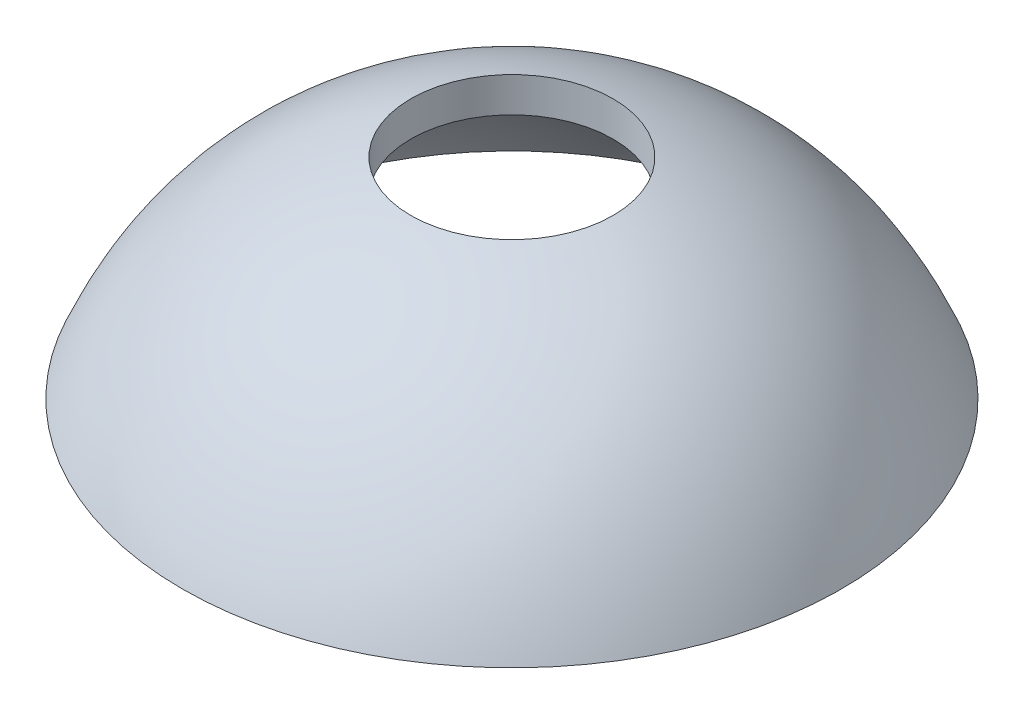
ISO-10303-21;
HEADER;
FILE_DESCRIPTION(('STEP AP214'),'2;1');
FILE_NAME('part.step','',(''),(''),'','','');
FILE_SCHEMA(('AUTOMOTIVE_DESIGN { 1 0 10303 214 1 1 1 1 }'));
ENDSEC;
DATA;
#1=APPLICATION_CONTEXT('core data for automotive mechanical design processes');
#2=APPLICATION_PROTOCOL_DEFINITION('international standard','automotive_design',2000,#1);
#3=PRODUCT_CONTEXT('',#1,'mechanical');
#4=PRODUCT('Part','Part','',(#3));
#5=PRODUCT_RELATED_PRODUCT_CATEGORY('part','',(#4));
#6=PRODUCT_DEFINITION_FORMATION('','',#4);
#7=PRODUCT_DEFINITION_CONTEXT('part definition',#1,'design');
#8=PRODUCT_DEFINITION('design','',#6,#7);
#9=PRODUCT_DEFINITION_SHAPE('','',#8);
#10=(LENGTH_UNIT() NAMED_UNIT(*) SI_UNIT(.MILLI.,.METRE.));
#11=(NAMED_UNIT(*) PLANE_ANGLE_UNIT() SI_UNIT($,.RADIAN.));
#12=(NAMED_UNIT(*) SI_UNIT($,.STERADIAN.) SOLID_ANGLE_UNIT());
#13=UNCERTAINTY_MEASURE_WITH_UNIT(LENGTH_MEASURE(1.E-05),#10,'distance_accuracy_value','');
#14=(GEOMETRIC_REPRESENTATION_CONTEXT(3) GLOBAL_UNCERTAINTY_ASSIGNED_CONTEXT((#13)) GLOBAL_UNIT_ASSIGNED_CONTEXT((#10,
#11,#12)) REPRESENTATION_CONTEXT('',''));
#15=CARTESIAN_POINT('',(0.,0.,0.));
#16=DIRECTION('',(0.,0.,1.));
#17=DIRECTION('',(1.,0.,0.));
#18=AXIS2_PLACEMENT_3D('',#15,#16,#17);
#19=CARTESIAN_POINT('',(24.003,0.,0.));
#20=CARTESIAN_POINT('',(19.1589458179204,11.7563582648025,0.));
#21=CARTESIAN_POINT('',(7.366,15.24,0.));
#22=B_SPLINE_CURVE_WITH_KNOTS('',2,(#19,#20,#21),.UNSPECIFIED.,.F.,.F.,(3,3),(0.,1.),.UNSPECIFIED.);
#23=CARTESIAN_POINT('',(0.,63.1497733533139,0.));
#24=DIRECTION('',(0.,1.,0.));
#25=AXIS1_PLACEMENT('',#23,#24);
#26=SURFACE_OF_REVOLUTION('',#22,#25);
#27=CARTESIAN_POINT('',(0.,15.24,0.));
#28=DIRECTION('',(0.,1.,0.));
#29=DIRECTION('',(0.,0.,1.));
#30=AXIS2_PLACEMENT_3D('',#27,#28,#29);
#31=CIRCLE('',#30,7.366);
#32=CARTESIAN_POINT('',(0.,15.24,7.366));
#33=VERTEX_POINT('',#32);
#34=EDGE_CURVE('E10',#33,#33,#31,.T.);
#35=ORIENTED_EDGE('',*,*,#34,.F.);
#36=EDGE_LOOP('',(#35));
#37=FACE_BOUND('',#36,.T.);
#38=CARTESIAN_POINT('',(0.,0.,0.));
#39=DIRECTION('',(0.,1.,0.));
#40=DIRECTION('',(0.,0.,1.));
#41=AXIS2_PLACEMENT_3D('',#38,#39,#40);
#42=CIRCLE('',#41,24.003);
#43=CARTESIAN_POINT('',(0.,0.,24.003));
#44=VERTEX_POINT('',#43);
#45=EDGE_CURVE('E46',#44,#44,#42,.T.);
#46=ORIENTED_EDGE('',*,*,#45,.T.);
#47=EDGE_LOOP('',(#46));
#48=FACE_BOUND('',#47,.T.);
#49=ADVANCED_FACE('F31',(#37,#48),#26,.T.);
#50=CARTESIAN_POINT('',(0.,63.1497733533139,0.));
#51=DIRECTION('',(0.,1.,0.));
#52=DIRECTION('',(0.,0.,1.));
#53=AXIS2_PLACEMENT_3D('',#50,#51,#52);
#54=CYLINDRICAL_SURFACE('',#53,7.366);
#55=CARTESIAN_POINT('',(0.,12.7,0.));
#56=DIRECTION('',(0.,1.,0.));
#57=DIRECTION('',(0.,0.,1.));
#58=AXIS2_PLACEMENT_3D('',#55,#56,#57);
#59=CIRCLE('',#58,7.366);
#60=CARTESIAN_POINT('',(0.,12.7,7.366));
#61=VERTEX_POINT('',#60);
#62=EDGE_CURVE('E38',#61,#61,#59,.T.);
#63=ORIENTED_EDGE('',*,*,#62,.F.);
#64=EDGE_LOOP('',(#63));
#65=FACE_BOUND('',#64,.T.);
#66=ORIENTED_EDGE('',*,*,#34,.T.);
#67=EDGE_LOOP('',(#66));
#68=FACE_BOUND('',#67,.T.);
#69=ADVANCED_FACE('F65',(#65,#68),#54,.F.);
#70=CARTESIAN_POINT('',(7.366,12.7,0.));
#71=CARTESIAN_POINT('',(17.5706945722861,9.69965450588187,0.));
#72=CARTESIAN_POINT('',(22.098,0.,0.));
#73=B_SPLINE_CURVE_WITH_KNOTS('',2,(#70,#71,#72),.UNSPECIFIED.,.F.,.F.,(3,3),(0.,1.),.UNSPECIFIED.);
#74=CARTESIAN_POINT('',(0.,63.1497733533139,0.));
#75=DIRECTION('',(0.,1.,0.));
#76=AXIS1_PLACEMENT('',#74,#75);
#77=SURFACE_OF_REVOLUTION('',#73,#76);
#78=CARTESIAN_POINT('',(0.,0.,0.));
#79=DIRECTION('',(0.,1.,0.));
#80=DIRECTION('',(0.,0.,1.));
#81=AXIS2_PLACEMENT_3D('',#78,#79,#80);
#82=CIRCLE('',#81,22.098);
#83=CARTESIAN_POINT('',(0.,0.,22.098));
#84=VERTEX_POINT('',#83);
#85=EDGE_CURVE('E42',#84,#84,#82,.T.);
#86=ORIENTED_EDGE('',*,*,#85,.F.);
#87=EDGE_LOOP('',(#86));
#88=FACE_BOUND('',#87,.T.);
#89=ORIENTED_EDGE('',*,*,#62,.T.);
#90=EDGE_LOOP('',(#89));
#91=FACE_BOUND('',#90,.T.);
#92=ADVANCED_FACE('F61',(#88,#91),#77,.T.);
#93=CARTESIAN_POINT('',(22.098,0.,0.));
#94=DIRECTION('',(0.,1.,0.));
#95=DIRECTION('',(0.,0.,1.));
#96=AXIS2_PLACEMENT_3D('',#93,#94,#95);
#97=PLANE('',#96);
#98=ORIENTED_EDGE('',*,*,#45,.F.);
#99=EDGE_LOOP('',(#98));
#100=FACE_BOUND('',#99,.T.);
#101=ORIENTED_EDGE('',*,*,#85,.T.);
#102=EDGE_LOOP('',(#101));
#103=FACE_BOUND('',#102,.T.);
#104=ADVANCED_FACE('F64',(#100,#103),#97,.F.);
#105=CLOSED_SHELL('',(#49,#69,#92,#104));
#106=MANIFOLD_SOLID_BREP('B2',#105);
#107=ADVANCED_BREP_SHAPE_REPRESENTATION('',(#18,#106),#14);
#108=SHAPE_DEFINITION_REPRESENTATION(#9,#107);
ENDSEC;
END-ISO-10303-21;
